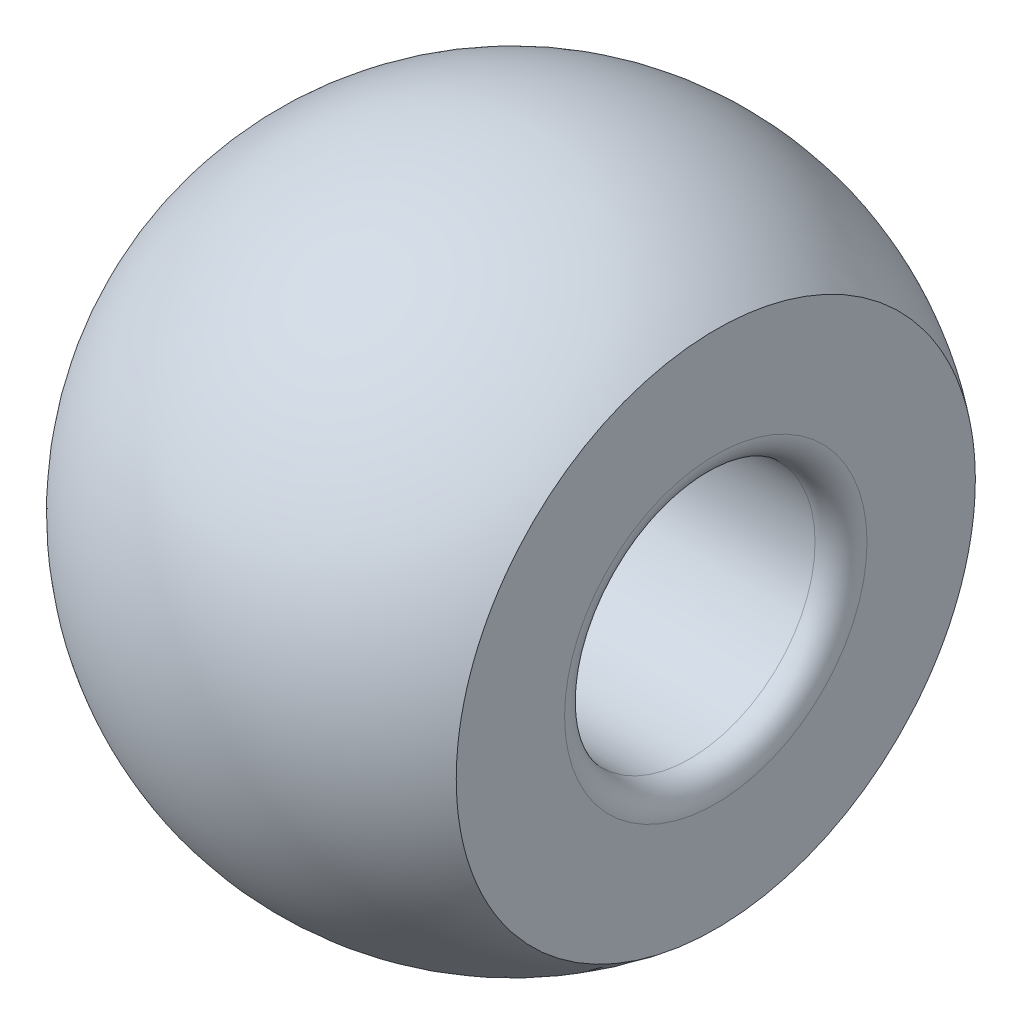
ISO-10303-21;
HEADER;
FILE_DESCRIPTION(('STEP AP214'),'2;1');
FILE_NAME('part.step','',(''),(''),'','','');
FILE_SCHEMA(('AUTOMOTIVE_DESIGN { 1 0 10303 214 1 1 1 1 }'));
ENDSEC;
DATA;
#1=APPLICATION_CONTEXT('core data for automotive mechanical design processes');
#2=APPLICATION_PROTOCOL_DEFINITION('international standard','automotive_design',2000,#1);
#3=PRODUCT_CONTEXT('',#1,'mechanical');
#4=PRODUCT('Part','Part','',(#3));
#5=PRODUCT_RELATED_PRODUCT_CATEGORY('part','',(#4));
#6=PRODUCT_DEFINITION_FORMATION('','',#4);
#7=PRODUCT_DEFINITION_CONTEXT('part definition',#1,'design');
#8=PRODUCT_DEFINITION('design','',#6,#7);
#9=PRODUCT_DEFINITION_SHAPE('','',#8);
#10=(LENGTH_UNIT() NAMED_UNIT(*) SI_UNIT(.MILLI.,.METRE.));
#11=(NAMED_UNIT(*) PLANE_ANGLE_UNIT() SI_UNIT($,.RADIAN.));
#12=(NAMED_UNIT(*) SI_UNIT($,.STERADIAN.) SOLID_ANGLE_UNIT());
#13=UNCERTAINTY_MEASURE_WITH_UNIT(LENGTH_MEASURE(1.E-05),#10,'distance_accuracy_value','');
#14=(GEOMETRIC_REPRESENTATION_CONTEXT(3) GLOBAL_UNCERTAINTY_ASSIGNED_CONTEXT((#13)) GLOBAL_UNIT_ASSIGNED_CONTEXT((#10,
#11,#12)) REPRESENTATION_CONTEXT('',''));
#15=CARTESIAN_POINT('',(0.,0.,0.));
#16=DIRECTION('',(0.,0.,1.));
#17=DIRECTION('',(1.,0.,0.));
#18=AXIS2_PLACEMENT_3D('',#15,#16,#17);
#19=CARTESIAN_POINT('',(-434.34241397916,0.,15.826));
#20=DIRECTION('',(1.,0.,0.));
#21=DIRECTION('',(0.,0.,-1.));
#22=AXIS2_PLACEMENT_3D('',#19,#20,#21);
#23=PLANE('',#22);
#24=CARTESIAN_POINT('',(-434.34241397916,0.,0.));
#25=DIRECTION('',(1.,0.,0.));
#26=DIRECTION('',(0.,0.,-1.));
#27=AXIS2_PLACEMENT_3D('',#24,#25,#26);
#28=CIRCLE('',#27,11.652);
#29=CARTESIAN_POINT('',(-434.34241397916,0.,-11.652));
#30=VERTEX_POINT('',#29);
#31=EDGE_CURVE('E12',#30,#30,#28,.F.);
#32=ORIENTED_EDGE('',*,*,#31,.T.);
#33=EDGE_LOOP('',(#32));
#34=FACE_BOUND('',#33,.T.);
#35=CARTESIAN_POINT('',(-434.34241397916,0.,19.9999999999999));
#36=CARTESIAN_POINT('',(-434.34241397916,-0.561906643485684,20.0000040315865));
#37=CARTESIAN_POINT('',(-434.34241397916,-1.12374712390291,19.9763098333528));
#38=CARTESIAN_POINT('',(-434.34241397916,-2.24362214573709,19.8816984484705));
#39=CARTESIAN_POINT('',(-434.34241397916,-2.80165564687379,19.8107688385622));
#40=CARTESIAN_POINT('',(-434.34241397916,-3.91037332781111,19.6220685878213));
#41=CARTESIAN_POINT('',(-434.34241397916,-4.46104867954383,19.5042461345184));
#42=CARTESIAN_POINT('',(-434.34241397916,-5.55047372654062,19.2226104267351));
#43=CARTESIAN_POINT('',(-434.34241397916,-6.08922421135753,19.0588002270181));
#44=CARTESIAN_POINT('',(-434.34241397916,-7.15075904926261,18.6864358077471));
#45=CARTESIAN_POINT('',(-434.34241397916,-7.67355052112212,18.4779018811916));
#46=CARTESIAN_POINT('',(-434.34241397916,-8.69971362055407,18.0175255221257));
#47=CARTESIAN_POINT('',(-434.34241397916,-9.20308494132895,17.765682405764));
#48=CARTESIAN_POINT('',(-434.34241397916,-10.1866935860316,17.2205504391732));
#49=CARTESIAN_POINT('',(-434.34241397916,-10.6669367733291,16.9272721684073));
#50=CARTESIAN_POINT('',(-434.34241397916,-11.6010112434995,16.3013072643973));
#51=CARTESIAN_POINT('',(-434.34241397916,-12.0548426296948,15.9686207853327));
#52=CARTESIAN_POINT('',(-434.34241397916,-12.9329165262548,15.2661657893792));
#53=CARTESIAN_POINT('',(-434.34241397916,-13.3571558868766,14.8963933352803));
#54=CARTESIAN_POINT('',(-434.34241397916,-14.1729771714857,14.1224242455879));
#55=CARTESIAN_POINT('',(-434.34241397916,-14.5645590623772,13.7182275751093));
#56=CARTESIAN_POINT('',(-434.34241397916,-15.3122957021046,12.878267483122));
#57=CARTESIAN_POINT('',(-434.34241397916,-15.6684490714482,12.4425028335813));
#58=CARTESIAN_POINT('',(-434.34241397916,-16.3427791317397,11.5425189284709));
#59=CARTESIAN_POINT('',(-434.34241397916,-16.6609558301228,11.0782996784722));
#60=CARTESIAN_POINT('',(-434.34241397916,-17.257064961129,10.1247158052815));
#61=CARTESIAN_POINT('',(-434.34241397916,-17.5349981409318,9.6353516491699));
#62=CARTESIAN_POINT('',(-434.34241397916,-18.0486513327212,8.63494911843998));
#63=CARTESIAN_POINT('',(-434.34241397916,-18.2843713439296,8.1239107434221));
#64=CARTESIAN_POINT('',(-434.34241397916,-18.7119219261933,7.08379402327592));
#65=CARTESIAN_POINT('',(-434.34241397916,-18.9037525860374,6.55471571464519));
#66=CARTESIAN_POINT('',(-434.34241397916,-19.2421612781737,5.48227956934927));
#67=CARTESIAN_POINT('',(-434.34241397916,-19.3887393105181,4.93892173270054));
#68=CARTESIAN_POINT('',(-434.34241397916,-19.6356009038078,3.84178842289251));
#69=CARTESIAN_POINT('',(-434.34241397916,-19.7358843763079,3.28801292983253));
#70=CARTESIAN_POINT('',(-434.34241397916,-19.8894434800563,2.17398233548621));
#71=CARTESIAN_POINT('',(-434.34241397916,-19.942719111318,1.61372723420172));
#72=CARTESIAN_POINT('',(-434.34241397916,-20.0018837209751,0.490721522680809));
#73=CARTESIAN_POINT('',(-434.34241397916,-20.0077727848732,-0.0720290830509836));
#74=CARTESIAN_POINT('',(-434.34241397916,-19.9721226166922,-1.19602599564782));
#75=CARTESIAN_POINT('',(-434.34241397916,-19.9305833846707,-1.75727230251469));
#76=CARTESIAN_POINT('',(-434.34241397916,-19.8003719188722,-2.87427070903834));
#77=CARTESIAN_POINT('',(-434.34241397916,-19.7116996674789,-3.43002280664154));
#78=CARTESIAN_POINT('',(-434.34241397916,-19.4878525578275,-4.53208152187594));
#79=CARTESIAN_POINT('',(-434.34241397916,-19.3526776995078,-5.07838813949463));
#80=CARTESIAN_POINT('',(-434.34241397916,-19.0367862201684,-6.15767255631228));
#81=CARTESIAN_POINT('',(-434.34241397916,-18.8560695510306,-6.69065034142773));
#82=CARTESIAN_POINT('',(-434.34241397916,-18.4503793092407,-7.73948733770365));
#83=CARTESIAN_POINT('',(-434.34241397916,-18.2254057365658,-8.25534654885533));
#84=CARTESIAN_POINT('',(-434.34241397916,-17.7328011971933,-9.26627877840625));
#85=CARTESIAN_POINT('',(-434.34241397916,-17.4651702443974,-9.7613518035795));
#86=CARTESIAN_POINT('',(-434.34241397916,-16.889153588844,-10.7271921652706));
#87=CARTESIAN_POINT('',(-434.34241397916,-16.5807678861162,-11.1979595018062));
#88=CARTESIAN_POINT('',(-434.34241397916,-15.9254343020073,-12.111841426233));
#89=CARTESIAN_POINT('',(-434.34241397916,-15.5784864362463,-12.5549560253252));
#90=CARTESIAN_POINT('',(-434.34241397916,-14.8484950148972,-13.4103824044834));
#91=CARTESIAN_POINT('',(-434.34241397916,-14.4654514593133,-13.822694184553));
#92=CARTESIAN_POINT('',(-434.34241397916,-13.6659918125191,-14.6135836914923));
#93=CARTESIAN_POINT('',(-434.34241397916,-13.2495757167295,-14.9921614137331));
#94=CARTESIAN_POINT('',(-434.34241397916,-12.3863315036972,-15.7128912810336));
#95=CARTESIAN_POINT('',(-434.34241397916,-11.9395033864469,-16.0550434260843));
#96=CARTESIAN_POINT('',(-434.34241397916,-11.018611750103,-16.7004896847796));
#97=CARTESIAN_POINT('',(-434.34241397916,-10.5445482274479,-17.0037837933427));
#98=CARTESIAN_POINT('',(-434.34241397916,-9.5725561414554,-17.5693576869072));
#99=CARTESIAN_POINT('',(-434.34241397916,-9.07462757811723,-17.8316374719072));
#100=CARTESIAN_POINT('',(-434.34241397916,-8.0584454068186,-18.313318055702));
#101=CARTESIAN_POINT('',(-434.34241397916,-7.54019179972949,-18.5327188563349));
#102=CARTESIAN_POINT('',(-434.34241397916,-6.48704399367935,-18.9270816770213));
#103=CARTESIAN_POINT('',(-434.34241397916,-5.95214979471962,-19.1020436970782));
#104=CARTESIAN_POINT('',(-434.34241397916,-4.86952360679911,-19.4062850746414));
#105=CARTESIAN_POINT('',(-434.34241397916,-4.32179161841705,-19.5355644342071));
#106=CARTESIAN_POINT('',(-434.34241397916,-3.21738387446764,-19.7475214029597));
#107=CARTESIAN_POINT('',(-434.34241397916,-2.66070811890054,-19.8301990121477));
#108=CARTESIAN_POINT('',(-434.34241397916,-1.54237047149849,-19.9483646919746));
#109=CARTESIAN_POINT('',(-434.34241397916,-0.980708579663551,-19.9838527626133));
#110=CARTESIAN_POINT('',(-434.34241397916,0.143608260931205,-20.007387066368));
#111=CARTESIAN_POINT('',(-434.34241397916,0.706263209691047,-19.9954332994827));
#112=CARTESIAN_POINT('',(-434.34241397916,1.82856605005664,-19.9241689107587));
#113=CARTESIAN_POINT('',(-434.34241397916,2.38821394152683,-19.8648582867853));
#114=CARTESIAN_POINT('',(-434.34241397916,3.50052388036403,-19.6993018441685));
#115=CARTESIAN_POINT('',(-434.34241397916,4.05318592773048,-19.5930560255215));
#116=CARTESIAN_POINT('',(-434.34241397916,5.14759510560844,-19.3343845322205));
#117=CARTESIAN_POINT('',(-434.34241397916,5.68934223565201,-19.1819588555869));
#118=CARTESIAN_POINT('',(-434.34241397916,6.75807005642663,-18.8320113032078));
#119=CARTESIAN_POINT('',(-434.34241397916,7.28505074715822,-18.634489427464));
#120=CARTESIAN_POINT('',(-434.34241397916,8.3204991041029,-18.1957537680375));
#121=CARTESIAN_POINT('',(-434.34241397916,8.828966772737,-17.9545399900686));
#122=CARTESIAN_POINT('',(-434.34241397916,9.82377425797822,-17.4301353941115));
#123=CARTESIAN_POINT('',(-434.34241397916,10.3101140745909,-17.146944576134));
#124=CARTESIAN_POINT('',(-434.34241397916,11.2572082066357,-16.5405992586084));
#125=CARTESIAN_POINT('',(-434.34241397916,11.7179625255787,-16.2174447645441));
#126=CARTESIAN_POINT('',(-434.34241397916,12.6106100485169,-15.5334694980357));
#127=CARTESIAN_POINT('',(-434.34241397916,13.0425032525088,-15.1726487255871));
#128=CARTESIAN_POINT('',(-434.34241397916,13.8743582135181,-14.4159059673798));
#129=CARTESIAN_POINT('',(-434.34241397916,14.2743199576012,-14.0199839674029));
#130=CARTESIAN_POINT('',(-434.34241397916,15.0394683149015,-13.195853648177));
#131=CARTESIAN_POINT('',(-434.34241397916,15.4046549280932,-12.7676453289046));
#132=CARTESIAN_POINT('',(-434.34241397916,16.0976568773463,-11.8819865327045));
#133=CARTESIAN_POINT('',(-434.34241397916,16.4254722012286,-11.4245360462471));
#134=CARTESIAN_POINT('',(-434.34241397916,17.0414008612587,-10.4836452434468));
#135=CARTESIAN_POINT('',(-434.34241397916,17.3295141974268,-10.0002049271172));
#136=CARTESIAN_POINT('',(-434.34241397916,17.8639902843092,-9.01077196240676));
#137=CARTESIAN_POINT('',(-434.34241397916,18.1103530791356,-8.50477933785471));
#138=CARTESIAN_POINT('',(-434.34241397916,18.5595769639765,-7.47383858222819));
#139=CARTESIAN_POINT('',(-434.34241397916,18.7624380540487,-6.94889045117881));
#140=CARTESIAN_POINT('',(-434.34241397916,19.1232162429864,-5.88377094408649));
#141=CARTESIAN_POINT('',(-434.34241397916,19.2811333586501,-5.34359957373344));
#142=CARTESIAN_POINT('',(-434.34241397916,19.5509010059571,-4.25187368758573));
#143=CARTESIAN_POINT('',(-434.34241397916,19.6627515375445,-3.70031917177727));
#144=CARTESIAN_POINT('',(-434.34241397916,19.8395909872496,-2.58974720734972));
#145=CARTESIAN_POINT('',(-434.34241397916,19.9045798208114,-2.03072974526656));
#146=CARTESIAN_POINT('',(-434.34241397916,19.9872335129027,-0.909207150457477));
#147=CARTESIAN_POINT('',(-434.34241397916,20.0048983714186,-0.346702017730561));
#148=CARTESIAN_POINT('',(-434.34241397916,19.9927785384234,0.777795761449103));
#149=CARTESIAN_POINT('',(-434.34241397916,19.9629939375633,1.33978840887889));
#150=CARTESIAN_POINT('',(-434.34241397916,19.8561871059442,2.45926687199022));
#151=CARTESIAN_POINT('',(-434.34241397916,19.7791648751308,3.01675268766656));
#152=CARTESIAN_POINT('',(-434.34241397916,19.5784301606351,4.12325522553894));
#153=CARTESIAN_POINT('',(-434.34241397916,19.454717582497,4.67227193059939));
#154=CARTESIAN_POINT('',(-434.34241397916,19.1614817155541,5.7579318917587));
#155=CARTESIAN_POINT('',(-434.34241397916,18.9919584275937,6.29457514808564));
#156=CARTESIAN_POINT('',(-434.34241397916,18.6083027849024,7.35168282808314));
#157=CARTESIAN_POINT('',(-434.34241397916,18.394169601876,7.8721469511409));
#158=CARTESIAN_POINT('',(-434.34241397916,17.922818444721,8.89318570962125));
#159=CARTESIAN_POINT('',(-434.34241397916,17.6656004621572,9.39376034114981));
#160=CARTESIAN_POINT('',(-434.34241397916,17.1099193054679,10.3714420330222));
#161=CARTESIAN_POINT('',(-434.34241397916,16.8114577370193,10.8485500059795));
#162=CARTESIAN_POINT('',(-434.34241397916,16.1754039085289,11.7759269775951));
#163=CARTESIAN_POINT('',(-434.34241397916,15.8378116881427,12.2261960034518));
#164=CARTESIAN_POINT('',(-434.34241397916,15.1259341620192,13.0966482864406));
#165=CARTESIAN_POINT('',(-434.34241397916,14.7516527593109,13.5168347355736));
#166=CARTESIAN_POINT('',(-434.34241397916,13.9690255777411,14.3241895965514));
#167=CARTESIAN_POINT('',(-434.34241397916,13.5606796656168,14.7113578792147));
#168=CARTESIAN_POINT('',(-434.34241397916,12.7127188208675,15.4500169566687));
#169=CARTESIAN_POINT('',(-434.34241397916,12.2730959433421,15.8014986310042));
#170=CARTESIAN_POINT('',(-434.34241397916,11.3658072257599,16.4661671811633));
#171=CARTESIAN_POINT('',(-434.34241397916,10.8981418286445,16.7793546616195));
#172=CARTESIAN_POINT('',(-434.34241397916,9.93786880069516,17.3653471399145));
#173=CARTESIAN_POINT('',(-434.34241397916,9.44524996724448,17.6381337806275));
#174=CARTESIAN_POINT('',(-434.34241397916,8.4387411690815,18.1412298391919));
#175=CARTESIAN_POINT('',(-434.34241397916,7.92484979383486,18.3715364347453));
#176=CARTESIAN_POINT('',(-434.34241397916,6.88005175711897,18.7877812462773));
#177=CARTESIAN_POINT('',(-434.34241397916,6.3491645570892,18.9737682856031));
#178=CARTESIAN_POINT('',(-434.34241397916,5.27379187705346,19.3003337119884));
#179=CARTESIAN_POINT('',(-434.34241397916,4.72931001069962,19.4409240305641));
#180=CARTESIAN_POINT('',(-434.34241397916,3.49356595858275,19.7050053087364));
#181=CARTESIAN_POINT('',(-434.34241397916,2.79949583983007,19.8155344379618));
#182=CARTESIAN_POINT('',(-434.34241397916,1.40358275056895,19.9630292661605));
#183=CARTESIAN_POINT('',(-434.34241397916,0.701739780060525,19.9999949651338));
#184=CARTESIAN_POINT('',(-434.34241397916,0.,19.9999999999999));
#185=B_SPLINE_CURVE_WITH_KNOTS('',3,(#35,#36,#37,#38,#39,#40,#41,#42,#43,#44,#45,#46,#47,#48,
#49,#50,#51,#52,#53,#54,#55,#56,#57,#58,#59,#60,#61,#62,#63,#64,#65,#66,#67,#68,#69,#70,#71,#72,
#73,#74,#75,#76,#77,#78,#79,#80,#81,#82,#83,#84,#85,#86,#87,#88,#89,#90,#91,#92,#93,#94,#95,#96,
#97,#98,#99,#100,#101,#102,#103,#104,#105,#106,#107,#108,#109,#110,#111,#112,#113,#114,#115,
#116,#117,#118,#119,#120,#121,#122,#123,#124,#125,#126,#127,#128,#129,#130,#131,#132,#133,#134,
#135,#136,#137,#138,#139,#140,#141,#142,#143,#144,#145,#146,#147,#148,#149,#150,#151,#152,#153,
#154,#155,#156,#157,#158,#159,#160,#161,#162,#163,#164,#165,#166,#167,#168,#169,#170,#171,#172,
#173,#174,#175,#176,#177,#178,#179,#180,#181,#182,#183,#184),.UNSPECIFIED.,.T.,.F.,(4,2,2,2,2,2,
2,2,2,2,2,2,2,2,2,2,2,2,2,2,2,2,2,2,2,2,2,2,2,2,2,2,2,2,2,2,2,2,2,2,2,2,2,2,2,2,2,2,2,2,2,2,2,2,
2,2,2,2,2,2,2,2,2,2,2,2,2,2,2,2,2,2,2,2,4),(0.,1.68510695974736,3.37065729011124,
5.0580751988956,6.74538104645097,8.4319229074558,10.118491401376,11.8046300464991,
13.4907620950435,15.1770733406415,16.8633862951573,18.5497648845237,20.2361431437266,
21.9224900888395,23.6088370650369,25.2951806296966,26.9815241924119,28.6678709768483,
30.3542177608023,32.0405615019728,33.7269052410973,35.4132496105047,37.099593982144,
38.785940135531,40.4722862897827,42.1586318944672,43.8449774979186,45.5313224182914,
47.217667338468,48.9040124900429,50.5903576420406,52.2767030145674,53.9630483871534,
55.649393687444,57.335738987603,59.0220842117435,60.7084294358387,62.394774659934,
64.0811198840745,65.7674651842334,67.4538104845241,69.1401558571101,70.8265012296368,
72.5128463816346,74.1991915332095,75.8855364533861,77.5718813737589,79.2582269772102,
80.9445725818948,82.6309187361465,84.3172648895335,86.0036092611728,87.6899536305802,
89.3762973697047,91.0626411108752,92.7489878948291,94.4353346792655,96.1216782419809,
97.8080218066405,99.494368782838,101.180715727951,102.867093987154,104.55347257652,
106.239785531036,107.926096776634,109.612228825178,111.298367470301,112.984935964222,
114.671477825227,116.358783672782,118.046201581566,119.73175191193,121.416858871677,
123.521312700477,125.625766529277),.UNSPECIFIED.);
#186=CARTESIAN_POINT('',(-434.34241397916,0.,19.9999999999999));
#187=VERTEX_POINT('',#186);
#188=EDGE_CURVE('E66',#187,#187,#185,.F.);
#189=ORIENTED_EDGE('',*,*,#188,.F.);
#190=EDGE_LOOP('',(#189));
#191=FACE_BOUND('',#190,.T.);
#192=ADVANCED_FACE('F45',(#34,#191),#23,.T.);
#193=CARTESIAN_POINT('',(-450.,0.,0.));
#194=DIRECTION('',(0.,0.,1.));
#195=DIRECTION('',(0.,-1.,0.));
#196=AXIS2_PLACEMENT_3D('',#193,#194,#195);
#197=SPHERICAL_SURFACE('',#196,25.4);
#198=CARTESIAN_POINT('',(-450.,0.,-25.4));
#199=VERTEX_POINT('',#198);
#200=VERTEX_LOOP('',#199);
#201=FACE_BOUND('',#200,.T.);
#202=CARTESIAN_POINT('',(-450.,0.,25.4));
#203=VERTEX_POINT('',#202);
#204=VERTEX_LOOP('',#203);
#205=FACE_BOUND('',#204,.T.);
#206=ORIENTED_EDGE('',*,*,#188,.T.);
#207=EDGE_LOOP('',(#206));
#208=FACE_BOUND('',#207,.T.);
#209=ADVANCED_FACE('F59',(#201,#205,#208),#197,.T.);
#210=CARTESIAN_POINT('',(-455.,0.,0.));
#211=DIRECTION('',(-1.,0.,0.));
#212=DIRECTION('',(0.,0.,1.));
#213=AXIS2_PLACEMENT_3D('',#210,#211,#212);
#214=PLANE('',#213);
#215=CARTESIAN_POINT('',(-455.,0.,0.));
#216=DIRECTION('',(1.,0.,0.));
#217=DIRECTION('',(0.,0.,-1.));
#218=AXIS2_PLACEMENT_3D('',#215,#216,#217);
#219=CIRCLE('',#218,9.65199999999999);
#220=CARTESIAN_POINT('',(-455.,0.,-9.65199999999999));
#221=VERTEX_POINT('',#220);
#222=EDGE_CURVE('E69',#221,#221,#219,.T.);
#223=ORIENTED_EDGE('',*,*,#222,.T.);
#224=EDGE_LOOP('',(#223));
#225=FACE_BOUND('',#224,.T.);
#226=ADVANCED_FACE('F62',(#225),#214,.F.);
#227=CARTESIAN_POINT('',(-434.34241397916,0.,0.));
#228=DIRECTION('',(1.,0.,0.));
#229=DIRECTION('',(0.,0.,-1.));
#230=AXIS2_PLACEMENT_3D('',#227,#228,#229);
#231=CYLINDRICAL_SURFACE('',#230,9.65199999999999);
#232=CARTESIAN_POINT('',(-436.34241397916,0.,0.));
#233=DIRECTION('',(1.,0.,0.));
#234=DIRECTION('',(0.,0.,-1.));
#235=AXIS2_PLACEMENT_3D('',#232,#233,#234);
#236=CIRCLE('',#235,9.65199999999999);
#237=CARTESIAN_POINT('',(-436.34241397916,0.,-9.65199999999999));
#238=VERTEX_POINT('',#237);
#239=EDGE_CURVE('E53',#238,#238,#236,.T.);
#240=ORIENTED_EDGE('',*,*,#239,.T.);
#241=EDGE_LOOP('',(#240));
#242=FACE_BOUND('',#241,.T.);
#243=ORIENTED_EDGE('',*,*,#222,.F.);
#244=EDGE_LOOP('',(#243));
#245=FACE_BOUND('',#244,.T.);
#246=ADVANCED_FACE('F86',(#242,#245),#231,.F.);
#247=CARTESIAN_POINT('',(-436.34241397916,0.,0.));
#248=DIRECTION('',(1.,0.,0.));
#249=DIRECTION('',(0.,0.,-1.));
#250=AXIS2_PLACEMENT_3D('',#247,#248,#249);
#251=TOROIDAL_SURFACE('',#250,11.652,2.);
#252=ORIENTED_EDGE('',*,*,#31,.F.);
#253=EDGE_LOOP('',(#252));
#254=FACE_BOUND('',#253,.T.);
#255=ORIENTED_EDGE('',*,*,#239,.F.);
#256=EDGE_LOOP('',(#255));
#257=FACE_BOUND('',#256,.T.);
#258=ADVANCED_FACE('F47',(#254,#257),#251,.T.);
#259=CLOSED_SHELL('',(#192,#209,#226,#246,#258));
#260=MANIFOLD_SOLID_BREP('B2',#259);
#261=ADVANCED_BREP_SHAPE_REPRESENTATION('',(#18,#260),#14);
#262=SHAPE_DEFINITION_REPRESENTATION(#9,#261);
ENDSEC;
END-ISO-10303-21;
